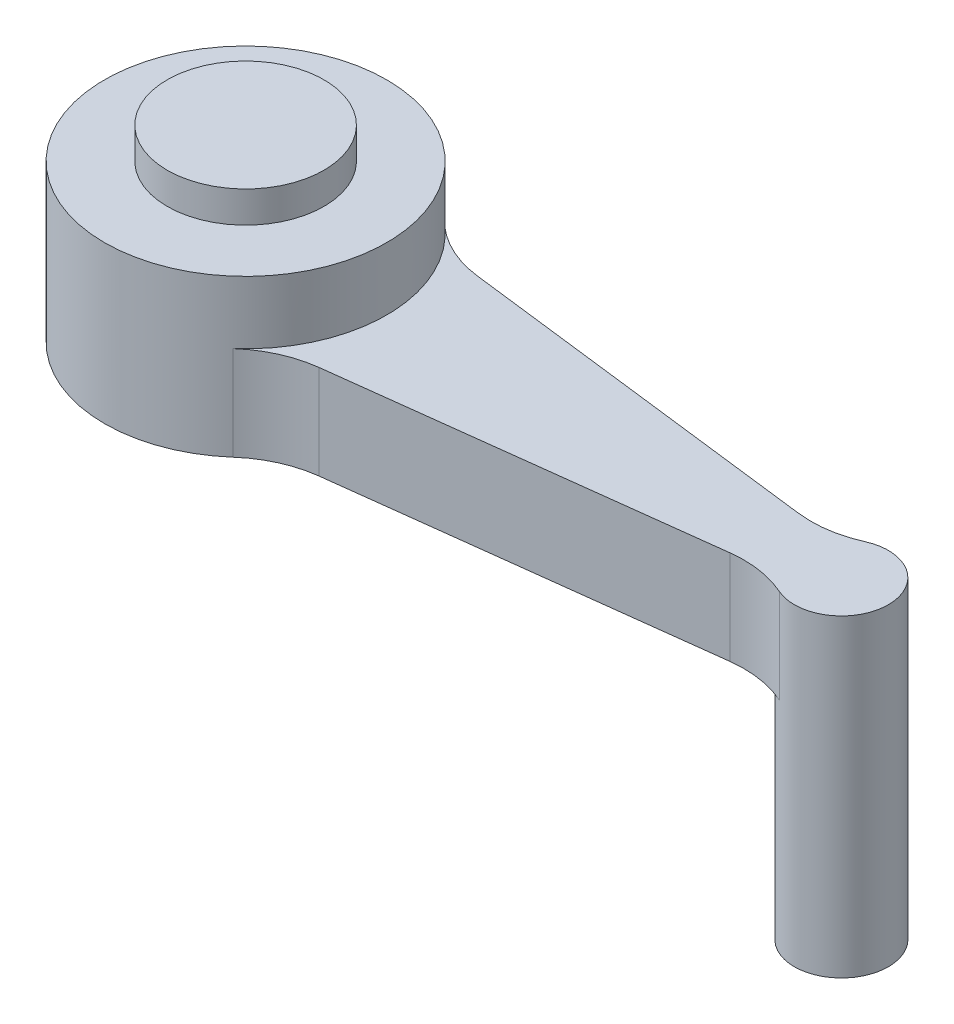
ISO-10303-21;
HEADER;
FILE_DESCRIPTION(('STEP AP214'),'2;1');
FILE_NAME('part.step','',(''),(''),'','','');
FILE_SCHEMA(('AUTOMOTIVE_DESIGN { 1 0 10303 214 1 1 1 1 }'));
ENDSEC;
DATA;
#1=APPLICATION_CONTEXT('core data for automotive mechanical design processes');
#2=APPLICATION_PROTOCOL_DEFINITION('international standard','automotive_design',2000,#1);
#3=PRODUCT_CONTEXT('',#1,'mechanical');
#4=PRODUCT('Part','Part','',(#3));
#5=PRODUCT_RELATED_PRODUCT_CATEGORY('part','',(#4));
#6=PRODUCT_DEFINITION_FORMATION('','',#4);
#7=PRODUCT_DEFINITION_CONTEXT('part definition',#1,'design');
#8=PRODUCT_DEFINITION('design','',#6,#7);
#9=PRODUCT_DEFINITION_SHAPE('','',#8);
#10=(LENGTH_UNIT() NAMED_UNIT(*) SI_UNIT(.MILLI.,.METRE.));
#11=(NAMED_UNIT(*) PLANE_ANGLE_UNIT() SI_UNIT($,.RADIAN.));
#12=(NAMED_UNIT(*) SI_UNIT($,.STERADIAN.) SOLID_ANGLE_UNIT());
#13=UNCERTAINTY_MEASURE_WITH_UNIT(LENGTH_MEASURE(1.E-05),#10,'distance_accuracy_value','');
#14=(GEOMETRIC_REPRESENTATION_CONTEXT(3) GLOBAL_UNCERTAINTY_ASSIGNED_CONTEXT((#13)) GLOBAL_UNIT_ASSIGNED_CONTEXT((#10,
#11,#12)) REPRESENTATION_CONTEXT('',''));
#15=CARTESIAN_POINT('',(0.,0.,0.));
#16=DIRECTION('',(0.,0.,1.));
#17=DIRECTION('',(1.,0.,0.));
#18=AXIS2_PLACEMENT_3D('',#15,#16,#17);
#19=CARTESIAN_POINT('',(-9.5,5.,0.));
#20=DIRECTION('',(0.,-1.,0.));
#21=DIRECTION('',(0.,0.,-1.));
#22=AXIS2_PLACEMENT_3D('',#19,#20,#21);
#23=CYLINDRICAL_SURFACE('',#22,4.5);
#24=CARTESIAN_POINT('',(-9.5,3.,0.));
#25=DIRECTION('',(0.,-1.,0.));
#26=DIRECTION('',(0.,0.,1.));
#27=AXIS2_PLACEMENT_3D('',#24,#25,#26);
#28=CIRCLE('',#27,4.5);
#29=CARTESIAN_POINT('',(-6.52352977505234,3.,-3.375));
#30=VERTEX_POINT('',#29);
#31=CARTESIAN_POINT('',(-6.52352977505234,3.,3.375));
#32=VERTEX_POINT('',#31);
#33=EDGE_CURVE('E59',#30,#32,#28,.T.);
#34=ORIENTED_EDGE('',*,*,#33,.F.);
#35=DIRECTION('',(0.,-1.,0.));
#36=VECTOR('',#35,1.);
#37=CARTESIAN_POINT('',(-6.52352977505234,3.,-3.375));
#38=LINE('',#37,#36);
#39=CARTESIAN_POINT('',(-6.52352977505234,0.,-3.375));
#40=VERTEX_POINT('',#39);
#41=EDGE_CURVE('E141',#30,#40,#38,.T.);
#42=ORIENTED_EDGE('',*,*,#41,.T.);
#43=CARTESIAN_POINT('',(-9.5,0.,0.));
#44=DIRECTION('',(0.,1.,0.));
#45=DIRECTION('',(0.,0.,1.));
#46=AXIS2_PLACEMENT_3D('',#43,#44,#45);
#47=CIRCLE('',#46,4.5);
#48=CARTESIAN_POINT('',(-6.52352977505234,0.,3.375));
#49=VERTEX_POINT('',#48);
#50=EDGE_CURVE('E42',#40,#49,#47,.T.);
#51=ORIENTED_EDGE('',*,*,#50,.T.);
#52=DIRECTION('',(0.,-1.,0.));
#53=VECTOR('',#52,1.);
#54=CARTESIAN_POINT('',(-6.52352977505234,3.,3.375));
#55=LINE('',#54,#53);
#56=EDGE_CURVE('E55',#32,#49,#55,.T.);
#57=ORIENTED_EDGE('',*,*,#56,.F.);
#58=EDGE_LOOP('',(#34,#42,#51,#57));
#59=FACE_BOUND('',#58,.T.);
#60=CARTESIAN_POINT('',(-9.5,5.,0.));
#61=DIRECTION('',(0.,1.,0.));
#62=DIRECTION('',(0.,0.,1.));
#63=AXIS2_PLACEMENT_3D('',#60,#61,#62);
#64=CIRCLE('',#63,4.5);
#65=CARTESIAN_POINT('',(-9.5,5.,4.5));
#66=VERTEX_POINT('',#65);
#67=EDGE_CURVE('E47',#66,#66,#64,.T.);
#68=ORIENTED_EDGE('',*,*,#67,.F.);
#69=EDGE_LOOP('',(#68));
#70=FACE_BOUND('',#69,.T.);
#71=ADVANCED_FACE('F39',(#59,#70),#23,.T.);
#72=CARTESIAN_POINT('',(-9.5,5.,0.));
#73=DIRECTION('',(0.,1.,0.));
#74=DIRECTION('',(0.,0.,1.));
#75=AXIS2_PLACEMENT_3D('',#72,#73,#74);
#76=PLANE('',#75);
#77=CARTESIAN_POINT('',(-9.5,5.,0.));
#78=DIRECTION('',(0.,1.,0.));
#79=DIRECTION('',(0.,0.,1.));
#80=AXIS2_PLACEMENT_3D('',#77,#78,#79);
#81=CIRCLE('',#80,2.5);
#82=CARTESIAN_POINT('',(-9.5,5.,2.5));
#83=VERTEX_POINT('',#82);
#84=EDGE_CURVE('E11',#83,#83,#81,.T.);
#85=ORIENTED_EDGE('',*,*,#84,.F.);
#86=EDGE_LOOP('',(#85));
#87=FACE_BOUND('',#86,.T.);
#88=ORIENTED_EDGE('',*,*,#67,.T.);
#89=EDGE_LOOP('',(#88));
#90=FACE_BOUND('',#89,.T.);
#91=ADVANCED_FACE('F206',(#87,#90),#76,.T.);
#92=CARTESIAN_POINT('',(-9.5,0.,0.));
#93=DIRECTION('',(0.,1.,0.));
#94=DIRECTION('',(0.,0.,1.));
#95=AXIS2_PLACEMENT_3D('',#92,#93,#94);
#96=PLANE('',#95);
#97=ORIENTED_EDGE('',*,*,#50,.F.);
#98=CARTESIAN_POINT('',(-4.20849737787082,0.,-6.));
#99=DIRECTION('',(0.,-1.,0.));
#100=DIRECTION('',(0.,0.,-1.));
#101=AXIS2_PLACEMENT_3D('',#98,#99,#100);
#102=CIRCLE('',#101,3.5);
#103=CARTESIAN_POINT('',(-4.63504007978884,0.,-2.52608846925537));
#104=VERTEX_POINT('',#103);
#105=EDGE_CURVE('E160',#104,#40,#102,.T.);
#106=ORIENTED_EDGE('',*,*,#105,.F.);
#107=DIRECTION('',(-0.992546151641322,0.,-0.121869343405148));
#108=VECTOR('',#107,1.);
#109=CARTESIAN_POINT('',(-4.63504007978884,0.,-2.52608846925537));
#110=LINE('',#109,#108);
#111=CARTESIAN_POINT('',(7.037637477802,0.,-1.09286388078539));
#112=VERTEX_POINT('',#111);
#113=EDGE_CURVE('E171',#112,#104,#110,.T.);
#114=ORIENTED_EDGE('',*,*,#113,.F.);
#115=CARTESIAN_POINT('',(7.46418017972002,0.,-4.56677541153002));
#116=DIRECTION('',(0.,-1.,0.));
#117=DIRECTION('',(0.,0.,1.));
#118=AXIS2_PLACEMENT_3D('',#115,#116,#117);
#119=CIRCLE('',#118,3.5);
#120=CARTESIAN_POINT('',(8.88925405391601,0.,-1.370032623459));
#121=VERTEX_POINT('',#120);
#122=EDGE_CURVE('E169',#121,#112,#119,.T.);
#123=ORIENTED_EDGE('',*,*,#122,.F.);
#124=CARTESIAN_POINT('',(9.5,0.,0.));
#125=DIRECTION('',(0.,-1.,0.));
#126=DIRECTION('',(0.,0.,1.));
#127=AXIS2_PLACEMENT_3D('',#124,#125,#126);
#128=CIRCLE('',#127,1.5);
#129=CARTESIAN_POINT('',(8.88925405391599,0.,1.370032623459));
#130=VERTEX_POINT('',#129);
#131=EDGE_CURVE('E167',#130,#121,#128,.T.);
#132=ORIENTED_EDGE('',*,*,#131,.F.);
#133=CARTESIAN_POINT('',(7.46418017972,0.,4.56677541153002));
#134=DIRECTION('',(0.,-1.,0.));
#135=DIRECTION('',(0.,0.,-1.));
#136=AXIS2_PLACEMENT_3D('',#133,#134,#135);
#137=CIRCLE('',#136,3.5);
#138=CARTESIAN_POINT('',(7.03763747780198,0.,1.09286388078539));
#139=VERTEX_POINT('',#138);
#140=EDGE_CURVE('E128',#139,#130,#137,.T.);
#141=ORIENTED_EDGE('',*,*,#140,.F.);
#142=DIRECTION('',(0.992546151641322,0.,-0.121869343405148));
#143=VECTOR('',#142,1.);
#144=CARTESIAN_POINT('',(-4.63504007978884,0.,2.52608846925537));
#145=LINE('',#144,#143);
#146=CARTESIAN_POINT('',(-4.63504007978884,0.,2.52608846925537));
#147=VERTEX_POINT('',#146);
#148=EDGE_CURVE('E159',#147,#139,#145,.T.);
#149=ORIENTED_EDGE('',*,*,#148,.F.);
#150=CARTESIAN_POINT('',(-4.20849737787082,0.,6.));
#151=DIRECTION('',(0.,-1.,0.));
#152=DIRECTION('',(0.,0.,1.));
#153=AXIS2_PLACEMENT_3D('',#150,#151,#152);
#154=CIRCLE('',#153,3.5);
#155=EDGE_CURVE('E155',#49,#147,#154,.T.);
#156=ORIENTED_EDGE('',*,*,#155,.F.);
#157=EDGE_LOOP('',(#97,#106,#114,#123,#132,#141,#149,#156));
#158=FACE_BOUND('',#157,.T.);
#159=ADVANCED_FACE('F158',(#158),#96,.F.);
#160=CARTESIAN_POINT('',(-4.20849737787082,3.,-6.));
#161=DIRECTION('',(0.,-1.,0.));
#162=DIRECTION('',(0.,0.,-1.));
#163=AXIS2_PLACEMENT_3D('',#160,#161,#162);
#164=CYLINDRICAL_SURFACE('',#163,3.5);
#165=ORIENTED_EDGE('',*,*,#105,.T.);
#166=ORIENTED_EDGE('',*,*,#41,.F.);
#167=CARTESIAN_POINT('',(-4.20849737787082,3.,-6.));
#168=DIRECTION('',(0.,-1.,0.));
#169=DIRECTION('',(0.,0.,-1.));
#170=AXIS2_PLACEMENT_3D('',#167,#168,#169);
#171=CIRCLE('',#170,3.5);
#172=CARTESIAN_POINT('',(-4.63504007978884,3.,-2.52608846925537));
#173=VERTEX_POINT('',#172);
#174=EDGE_CURVE('E173',#173,#30,#171,.T.);
#175=ORIENTED_EDGE('',*,*,#174,.F.);
#176=DIRECTION('',(0.,-1.,0.));
#177=VECTOR('',#176,1.);
#178=CARTESIAN_POINT('',(-4.63504007978884,3.,-2.52608846925537));
#179=LINE('',#178,#177);
#180=EDGE_CURVE('E174',#173,#104,#179,.T.);
#181=ORIENTED_EDGE('',*,*,#180,.T.);
#182=EDGE_LOOP('',(#165,#166,#175,#181));
#183=FACE_BOUND('',#182,.T.);
#184=ADVANCED_FACE('F187',(#183),#164,.F.);
#185=CARTESIAN_POINT('',(-4.20849737787082,3.,6.));
#186=DIRECTION('',(0.,-1.,0.));
#187=DIRECTION('',(0.,0.,-1.));
#188=AXIS2_PLACEMENT_3D('',#185,#186,#187);
#189=CYLINDRICAL_SURFACE('',#188,3.5);
#190=ORIENTED_EDGE('',*,*,#155,.T.);
#191=DIRECTION('',(0.,-1.,0.));
#192=VECTOR('',#191,1.);
#193=CARTESIAN_POINT('',(-4.63504007978884,3.,2.52608846925537));
#194=LINE('',#193,#192);
#195=CARTESIAN_POINT('',(-4.63504007978884,3.,2.52608846925537));
#196=VERTEX_POINT('',#195);
#197=EDGE_CURVE('E132',#196,#147,#194,.T.);
#198=ORIENTED_EDGE('',*,*,#197,.F.);
#199=CARTESIAN_POINT('',(-4.20849737787082,3.,6.));
#200=DIRECTION('',(0.,-1.,0.));
#201=DIRECTION('',(0.,0.,1.));
#202=AXIS2_PLACEMENT_3D('',#199,#200,#201);
#203=CIRCLE('',#202,3.5);
#204=EDGE_CURVE('E156',#32,#196,#203,.T.);
#205=ORIENTED_EDGE('',*,*,#204,.F.);
#206=ORIENTED_EDGE('',*,*,#56,.T.);
#207=EDGE_LOOP('',(#190,#198,#205,#206));
#208=FACE_BOUND('',#207,.T.);
#209=ADVANCED_FACE('F153',(#208),#189,.F.);
#210=CARTESIAN_POINT('',(-4.63504007978884,3.,2.52608846925537));
#211=DIRECTION('',(-0.121869343405148,0.,-0.992546151641322));
#212=DIRECTION('',(-0.992546151641322,0.,0.121869343405148));
#213=AXIS2_PLACEMENT_3D('',#210,#211,#212);
#214=PLANE('',#213);
#215=ORIENTED_EDGE('',*,*,#148,.T.);
#216=DIRECTION('',(0.,-1.,0.));
#217=VECTOR('',#216,1.);
#218=CARTESIAN_POINT('',(7.03763747780198,3.,1.09286388078539));
#219=LINE('',#218,#217);
#220=CARTESIAN_POINT('',(7.03763747780198,3.,1.09286388078539));
#221=VERTEX_POINT('',#220);
#222=EDGE_CURVE('E130',#221,#139,#219,.T.);
#223=ORIENTED_EDGE('',*,*,#222,.F.);
#224=DIRECTION('',(0.992546151641322,0.,-0.121869343405148));
#225=VECTOR('',#224,1.);
#226=CARTESIAN_POINT('',(-4.63504007978884,3.,2.52608846925537));
#227=LINE('',#226,#225);
#228=EDGE_CURVE('E120',#196,#221,#227,.T.);
#229=ORIENTED_EDGE('',*,*,#228,.F.);
#230=ORIENTED_EDGE('',*,*,#197,.T.);
#231=EDGE_LOOP('',(#215,#223,#229,#230));
#232=FACE_BOUND('',#231,.T.);
#233=ADVANCED_FACE('F203',(#232),#214,.F.);
#234=CARTESIAN_POINT('',(7.46418017972,3.,4.56677541153002));
#235=DIRECTION('',(0.,-1.,0.));
#236=DIRECTION('',(0.,0.,-1.));
#237=AXIS2_PLACEMENT_3D('',#234,#235,#236);
#238=CYLINDRICAL_SURFACE('',#237,3.5);
#239=ORIENTED_EDGE('',*,*,#140,.T.);
#240=DIRECTION('',(0.,-1.,0.));
#241=VECTOR('',#240,1.);
#242=CARTESIAN_POINT('',(8.88925405391599,3.,1.370032623459));
#243=LINE('',#242,#241);
#244=CARTESIAN_POINT('',(8.889254053916,3.,1.370032623459));
#245=VERTEX_POINT('',#244);
#246=EDGE_CURVE('E107',#245,#130,#243,.T.);
#247=ORIENTED_EDGE('',*,*,#246,.F.);
#248=CARTESIAN_POINT('',(7.46418017972,3.,4.56677541153002));
#249=DIRECTION('',(0.,-1.,0.));
#250=DIRECTION('',(0.,0.,-1.));
#251=AXIS2_PLACEMENT_3D('',#248,#249,#250);
#252=CIRCLE('',#251,3.5);
#253=EDGE_CURVE('E117',#221,#245,#252,.T.);
#254=ORIENTED_EDGE('',*,*,#253,.F.);
#255=ORIENTED_EDGE('',*,*,#222,.T.);
#256=EDGE_LOOP('',(#239,#247,#254,#255));
#257=FACE_BOUND('',#256,.T.);
#258=ADVANCED_FACE('F126',(#257),#238,.F.);
#259=CARTESIAN_POINT('',(7.46418017972002,3.,-4.56677541153002));
#260=DIRECTION('',(0.,-1.,0.));
#261=DIRECTION('',(0.,0.,-1.));
#262=AXIS2_PLACEMENT_3D('',#259,#260,#261);
#263=CYLINDRICAL_SURFACE('',#262,3.5);
#264=ORIENTED_EDGE('',*,*,#122,.T.);
#265=DIRECTION('',(0.,-1.,0.));
#266=VECTOR('',#265,1.);
#267=CARTESIAN_POINT('',(7.037637477802,3.,-1.09286388078539));
#268=LINE('',#267,#266);
#269=CARTESIAN_POINT('',(7.037637477802,3.,-1.09286388078539));
#270=VERTEX_POINT('',#269);
#271=EDGE_CURVE('E134',#270,#112,#268,.T.);
#272=ORIENTED_EDGE('',*,*,#271,.F.);
#273=CARTESIAN_POINT('',(7.46418017972002,3.,-4.56677541153002));
#274=DIRECTION('',(0.,-1.,0.));
#275=DIRECTION('',(0.,0.,1.));
#276=AXIS2_PLACEMENT_3D('',#273,#274,#275);
#277=CIRCLE('',#276,3.5);
#278=CARTESIAN_POINT('',(8.88925405391601,3.,-1.370032623459));
#279=VERTEX_POINT('',#278);
#280=EDGE_CURVE('E124',#279,#270,#277,.T.);
#281=ORIENTED_EDGE('',*,*,#280,.F.);
#282=DIRECTION('',(0.,-1.,0.));
#283=VECTOR('',#282,1.);
#284=CARTESIAN_POINT('',(8.88925405391601,3.,-1.370032623459));
#285=LINE('',#284,#283);
#286=EDGE_CURVE('E110',#279,#121,#285,.T.);
#287=ORIENTED_EDGE('',*,*,#286,.T.);
#288=EDGE_LOOP('',(#264,#272,#281,#287));
#289=FACE_BOUND('',#288,.T.);
#290=ADVANCED_FACE('F195',(#289),#263,.F.);
#291=CARTESIAN_POINT('',(-4.63504007978884,3.,-2.52608846925537));
#292=DIRECTION('',(-0.121869343405148,0.,0.992546151641322));
#293=DIRECTION('',(0.992546151641322,0.,0.121869343405148));
#294=AXIS2_PLACEMENT_3D('',#291,#292,#293);
#295=PLANE('',#294);
#296=ORIENTED_EDGE('',*,*,#113,.T.);
#297=ORIENTED_EDGE('',*,*,#180,.F.);
#298=DIRECTION('',(-0.992546151641322,0.,-0.121869343405148));
#299=VECTOR('',#298,1.);
#300=CARTESIAN_POINT('',(-4.63504007978884,3.,-2.52608846925537));
#301=LINE('',#300,#299);
#302=EDGE_CURVE('E176',#270,#173,#301,.T.);
#303=ORIENTED_EDGE('',*,*,#302,.F.);
#304=ORIENTED_EDGE('',*,*,#271,.T.);
#305=EDGE_LOOP('',(#296,#297,#303,#304));
#306=FACE_BOUND('',#305,.T.);
#307=ADVANCED_FACE('F182',(#306),#295,.F.);
#308=CARTESIAN_POINT('',(-4.20849737787082,3.,-6.));
#309=DIRECTION('',(0.,-1.,0.));
#310=DIRECTION('',(0.,0.,-1.));
#311=AXIS2_PLACEMENT_3D('',#308,#309,#310);
#312=PLANE('',#311);
#313=ORIENTED_EDGE('',*,*,#174,.T.);
#314=ORIENTED_EDGE('',*,*,#33,.T.);
#315=ORIENTED_EDGE('',*,*,#204,.T.);
#316=ORIENTED_EDGE('',*,*,#228,.T.);
#317=ORIENTED_EDGE('',*,*,#253,.T.);
#318=CARTESIAN_POINT('',(9.5,3.,0.));
#319=DIRECTION('',(0.,1.,0.));
#320=DIRECTION('',(0.,0.,1.));
#321=AXIS2_PLACEMENT_3D('',#318,#319,#320);
#322=CIRCLE('',#321,1.5);
#323=EDGE_CURVE('E103',#245,#279,#322,.T.);
#324=ORIENTED_EDGE('',*,*,#323,.T.);
#325=ORIENTED_EDGE('',*,*,#280,.T.);
#326=ORIENTED_EDGE('',*,*,#302,.T.);
#327=EDGE_LOOP('',(#313,#314,#315,#316,#317,#324,#325,#326));
#328=FACE_BOUND('',#327,.T.);
#329=ADVANCED_FACE('F118',(#328),#312,.F.);
#330=CARTESIAN_POINT('',(9.5,-7.,0.));
#331=DIRECTION('',(0.,1.,0.));
#332=DIRECTION('',(0.,0.,1.));
#333=AXIS2_PLACEMENT_3D('',#330,#331,#332);
#334=CYLINDRICAL_SURFACE('',#333,1.5);
#335=CARTESIAN_POINT('',(9.5,-7.,0.));
#336=DIRECTION('',(0.,1.,0.));
#337=DIRECTION('',(0.,0.,1.));
#338=AXIS2_PLACEMENT_3D('',#335,#336,#337);
#339=CIRCLE('',#338,1.5);
#340=CARTESIAN_POINT('',(9.5,-7.,1.5));
#341=VERTEX_POINT('',#340);
#342=EDGE_CURVE('E113',#341,#341,#339,.T.);
#343=ORIENTED_EDGE('',*,*,#342,.T.);
#344=EDGE_LOOP('',(#343));
#345=FACE_BOUND('',#344,.T.);
#346=ORIENTED_EDGE('',*,*,#246,.T.);
#347=ORIENTED_EDGE('',*,*,#131,.T.);
#348=ORIENTED_EDGE('',*,*,#286,.F.);
#349=ORIENTED_EDGE('',*,*,#323,.F.);
#350=EDGE_LOOP('',(#346,#347,#348,#349));
#351=FACE_BOUND('',#350,.T.);
#352=ADVANCED_FACE('F105',(#345,#351),#334,.T.);
#353=CARTESIAN_POINT('',(9.5,-7.,0.));
#354=DIRECTION('',(0.,1.,0.));
#355=DIRECTION('',(0.,0.,1.));
#356=AXIS2_PLACEMENT_3D('',#353,#354,#355);
#357=PLANE('',#356);
#358=ORIENTED_EDGE('',*,*,#342,.F.);
#359=EDGE_LOOP('',(#358));
#360=FACE_BOUND('',#359,.T.);
#361=ADVANCED_FACE('F263',(#360),#357,.F.);
#362=CARTESIAN_POINT('',(-9.5,6.,0.));
#363=DIRECTION('',(0.,-1.,0.));
#364=DIRECTION('',(0.,0.,-1.));
#365=AXIS2_PLACEMENT_3D('',#362,#363,#364);
#366=CYLINDRICAL_SURFACE('',#365,2.5);
#367=CARTESIAN_POINT('',(-9.5,6.,0.));
#368=DIRECTION('',(0.,1.,0.));
#369=DIRECTION('',(0.,0.,1.));
#370=AXIS2_PLACEMENT_3D('',#367,#368,#369);
#371=CIRCLE('',#370,2.5);
#372=CARTESIAN_POINT('',(-9.5,6.,2.5));
#373=VERTEX_POINT('',#372);
#374=EDGE_CURVE('E114',#373,#373,#371,.T.);
#375=ORIENTED_EDGE('',*,*,#374,.F.);
#376=EDGE_LOOP('',(#375));
#377=FACE_BOUND('',#376,.T.);
#378=ORIENTED_EDGE('',*,*,#84,.T.);
#379=EDGE_LOOP('',(#378));
#380=FACE_BOUND('',#379,.T.);
#381=ADVANCED_FACE('F275',(#377,#380),#366,.T.);
#382=CARTESIAN_POINT('',(-9.5,6.,0.));
#383=DIRECTION('',(0.,1.,0.));
#384=DIRECTION('',(0.,0.,1.));
#385=AXIS2_PLACEMENT_3D('',#382,#383,#384);
#386=PLANE('',#385);
#387=ORIENTED_EDGE('',*,*,#374,.T.);
#388=EDGE_LOOP('',(#387));
#389=FACE_BOUND('',#388,.T.);
#390=ADVANCED_FACE('F292',(#389),#386,.T.);
#391=CLOSED_SHELL('',(#71,#91,#159,#184,#209,#233,#258,#290,#307,#329,#352,#361,#381,#390));
#392=MANIFOLD_SOLID_BREP('B2',#391);
#393=ADVANCED_BREP_SHAPE_REPRESENTATION('',(#18,#392),#14);
#394=SHAPE_DEFINITION_REPRESENTATION(#9,#393);
ENDSEC;
END-ISO-10303-21;
